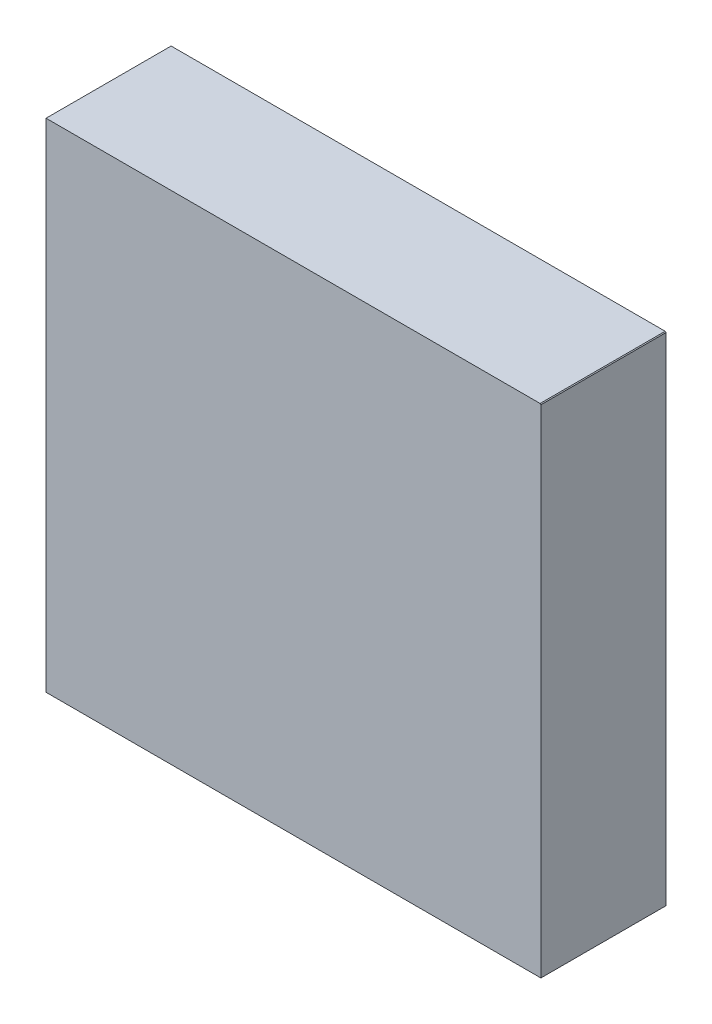
ISO-10303-21;
HEADER;
FILE_DESCRIPTION(('STEP AP214'),'2;1');
FILE_NAME('part.step','',(''),(''),'','','');
FILE_SCHEMA(('AUTOMOTIVE_DESIGN { 1 0 10303 214 1 1 1 1 }'));
ENDSEC;
DATA;
#1=APPLICATION_CONTEXT('core data for automotive mechanical design processes');
#2=APPLICATION_PROTOCOL_DEFINITION('international standard','automotive_design',2000,#1);
#3=PRODUCT_CONTEXT('',#1,'mechanical');
#4=PRODUCT('Part','Part','',(#3));
#5=PRODUCT_RELATED_PRODUCT_CATEGORY('part','',(#4));
#6=PRODUCT_DEFINITION_FORMATION('','',#4);
#7=PRODUCT_DEFINITION_CONTEXT('part definition',#1,'design');
#8=PRODUCT_DEFINITION('design','',#6,#7);
#9=PRODUCT_DEFINITION_SHAPE('','',#8);
#10=(LENGTH_UNIT() NAMED_UNIT(*) SI_UNIT(.MILLI.,.METRE.));
#11=(NAMED_UNIT(*) PLANE_ANGLE_UNIT() SI_UNIT($,.RADIAN.));
#12=(NAMED_UNIT(*) SI_UNIT($,.STERADIAN.) SOLID_ANGLE_UNIT());
#13=UNCERTAINTY_MEASURE_WITH_UNIT(LENGTH_MEASURE(1.E-05),#10,'distance_accuracy_value','');
#14=(GEOMETRIC_REPRESENTATION_CONTEXT(3) GLOBAL_UNCERTAINTY_ASSIGNED_CONTEXT((#13)) GLOBAL_UNIT_ASSIGNED_CONTEXT((#10,
#11,#12)) REPRESENTATION_CONTEXT('',''));
#15=CARTESIAN_POINT('',(0.,0.,0.));
#16=DIRECTION('',(0.,0.,1.));
#17=DIRECTION('',(1.,0.,0.));
#18=AXIS2_PLACEMENT_3D('',#15,#16,#17);
#19=CARTESIAN_POINT('',(-1.58250128,1.58999936,0.80000094));
#20=DIRECTION('',(0.,0.,-1.));
#21=DIRECTION('',(0.,-1.,0.));
#22=AXIS2_PLACEMENT_3D('',#19,#20,#21);
#23=PLANE('',#22);
#24=DIRECTION('',(0.,-1.,0.));
#25=VECTOR('',#24,1.);
#26=CARTESIAN_POINT('',(-1.58250128,1.58999936,0.80000094));
#27=LINE('',#26,#25);
#28=CARTESIAN_POINT('',(-1.58250128,1.58999936,0.80000094));
#29=VERTEX_POINT('',#28);
#30=CARTESIAN_POINT('',(-1.5824962,-1.58999682,0.80000094));
#31=VERTEX_POINT('',#30);
#32=EDGE_CURVE('E93',#29,#31,#27,.T.);
#33=ORIENTED_EDGE('',*,*,#32,.T.);
#34=DIRECTION('',(1.,0.,0.));
#35=VECTOR('',#34,1.);
#36=CARTESIAN_POINT('',(-1.5824962,-1.58999682,0.80000094));
#37=LINE('',#36,#35);
#38=CARTESIAN_POINT('',(1.58250128,-1.58999682,0.80000094));
#39=VERTEX_POINT('',#38);
#40=EDGE_CURVE('E91',#31,#39,#37,.T.);
#41=ORIENTED_EDGE('',*,*,#40,.T.);
#42=DIRECTION('',(0.,1.,0.));
#43=VECTOR('',#42,1.);
#44=CARTESIAN_POINT('',(1.58250128,-1.58999682,0.80000094));
#45=LINE('',#44,#43);
#46=CARTESIAN_POINT('',(1.58250128,1.5849981,0.80000094));
#47=VERTEX_POINT('',#46);
#48=EDGE_CURVE('E77',#39,#47,#45,.T.);
#49=ORIENTED_EDGE('',*,*,#48,.T.);
#50=DIRECTION('',(-0.707106781186548,0.707106781186548,0.));
#51=VECTOR('',#50,1.);
#52=CARTESIAN_POINT('',(1.58250128,1.5849981,0.80000094));
#53=LINE('',#52,#51);
#54=CARTESIAN_POINT('',(1.57750002,1.58999936,0.80000094));
#55=VERTEX_POINT('',#54);
#56=EDGE_CURVE('E119',#47,#55,#53,.T.);
#57=ORIENTED_EDGE('',*,*,#56,.T.);
#58=DIRECTION('',(-1.,0.,0.));
#59=VECTOR('',#58,1.);
#60=CARTESIAN_POINT('',(1.57750002,1.58999936,0.80000094));
#61=LINE('',#60,#59);
#62=EDGE_CURVE('E26',#55,#29,#61,.T.);
#63=ORIENTED_EDGE('',*,*,#62,.T.);
#64=EDGE_LOOP('',(#33,#41,#49,#57,#63));
#65=FACE_BOUND('',#64,.T.);
#66=ADVANCED_FACE('F17',(#65),#23,.F.);
#67=CARTESIAN_POINT('',(-1.58250128,1.58999936,0.));
#68=DIRECTION('',(0.,0.,-1.));
#69=DIRECTION('',(0.,-1.,0.));
#70=AXIS2_PLACEMENT_3D('',#67,#68,#69);
#71=PLANE('',#70);
#72=DIRECTION('',(-1.,0.,0.));
#73=VECTOR('',#72,1.);
#74=CARTESIAN_POINT('',(1.57750002,1.58999936,0.));
#75=LINE('',#74,#73);
#76=CARTESIAN_POINT('',(1.57750002,1.58999936,0.));
#77=VERTEX_POINT('',#76);
#78=CARTESIAN_POINT('',(-1.58250128,1.58999936,0.));
#79=VERTEX_POINT('',#78);
#80=EDGE_CURVE('E122',#77,#79,#75,.T.);
#81=ORIENTED_EDGE('',*,*,#80,.F.);
#82=DIRECTION('',(-0.707106781186548,0.707106781186548,0.));
#83=VECTOR('',#82,1.);
#84=CARTESIAN_POINT('',(1.58250128,1.5849981,0.));
#85=LINE('',#84,#83);
#86=CARTESIAN_POINT('',(1.58250128,1.5849981,0.));
#87=VERTEX_POINT('',#86);
#88=EDGE_CURVE('E87',#87,#77,#85,.T.);
#89=ORIENTED_EDGE('',*,*,#88,.F.);
#90=DIRECTION('',(0.,1.,0.));
#91=VECTOR('',#90,1.);
#92=CARTESIAN_POINT('',(1.58250128,-1.58999682,0.));
#93=LINE('',#92,#91);
#94=CARTESIAN_POINT('',(1.58250128,-1.58999682,0.));
#95=VERTEX_POINT('',#94);
#96=EDGE_CURVE('E69',#95,#87,#93,.T.);
#97=ORIENTED_EDGE('',*,*,#96,.F.);
#98=DIRECTION('',(1.,0.,0.));
#99=VECTOR('',#98,1.);
#100=CARTESIAN_POINT('',(-1.5824962,-1.58999682,0.));
#101=LINE('',#100,#99);
#102=CARTESIAN_POINT('',(-1.5824962,-1.58999682,0.));
#103=VERTEX_POINT('',#102);
#104=EDGE_CURVE('E98',#103,#95,#101,.T.);
#105=ORIENTED_EDGE('',*,*,#104,.F.);
#106=DIRECTION('',(0.,-1.,0.));
#107=VECTOR('',#106,1.);
#108=CARTESIAN_POINT('',(-1.58250128,1.58999936,0.));
#109=LINE('',#108,#107);
#110=EDGE_CURVE('E128',#79,#103,#109,.T.);
#111=ORIENTED_EDGE('',*,*,#110,.F.);
#112=EDGE_LOOP('',(#81,#89,#97,#105,#111));
#113=FACE_BOUND('',#112,.T.);
#114=ADVANCED_FACE('F145',(#113),#71,.T.);
#115=CARTESIAN_POINT('',(1.57750002,1.58999936,0.));
#116=DIRECTION('',(0.,-1.,0.));
#117=DIRECTION('',(0.,0.,-1.));
#118=AXIS2_PLACEMENT_3D('',#115,#116,#117);
#119=PLANE('',#118);
#120=ORIENTED_EDGE('',*,*,#80,.T.);
#121=DIRECTION('',(0.,0.,1.));
#122=VECTOR('',#121,1.);
#123=CARTESIAN_POINT('',(-1.58250128,1.58999936,0.));
#124=LINE('',#123,#122);
#125=EDGE_CURVE('E105',#79,#29,#124,.T.);
#126=ORIENTED_EDGE('',*,*,#125,.T.);
#127=ORIENTED_EDGE('',*,*,#62,.F.);
#128=DIRECTION('',(0.,0.,1.));
#129=VECTOR('',#128,1.);
#130=CARTESIAN_POINT('',(1.57750002,1.58999936,0.));
#131=LINE('',#130,#129);
#132=EDGE_CURVE('E113',#77,#55,#131,.T.);
#133=ORIENTED_EDGE('',*,*,#132,.F.);
#134=EDGE_LOOP('',(#120,#126,#127,#133));
#135=FACE_BOUND('',#134,.T.);
#136=ADVANCED_FACE('F147',(#135),#119,.F.);
#137=CARTESIAN_POINT('',(1.58250128,1.5849981,0.));
#138=DIRECTION('',(-0.707106781186548,-0.707106781186548,0.));
#139=DIRECTION('',(-0.707106781186548,0.707106781186548,0.));
#140=AXIS2_PLACEMENT_3D('',#137,#138,#139);
#141=PLANE('',#140);
#142=ORIENTED_EDGE('',*,*,#88,.T.);
#143=ORIENTED_EDGE('',*,*,#132,.T.);
#144=ORIENTED_EDGE('',*,*,#56,.F.);
#145=DIRECTION('',(0.,0.,1.));
#146=VECTOR('',#145,1.);
#147=CARTESIAN_POINT('',(1.58250128,1.5849981,0.));
#148=LINE('',#147,#146);
#149=EDGE_CURVE('E84',#87,#47,#148,.T.);
#150=ORIENTED_EDGE('',*,*,#149,.F.);
#151=EDGE_LOOP('',(#142,#143,#144,#150));
#152=FACE_BOUND('',#151,.T.);
#153=ADVANCED_FACE('F153',(#152),#141,.F.);
#154=CARTESIAN_POINT('',(1.58250128,-1.58999682,0.));
#155=DIRECTION('',(-1.,0.,0.));
#156=DIRECTION('',(0.,0.,1.));
#157=AXIS2_PLACEMENT_3D('',#154,#155,#156);
#158=PLANE('',#157);
#159=ORIENTED_EDGE('',*,*,#96,.T.);
#160=ORIENTED_EDGE('',*,*,#149,.T.);
#161=ORIENTED_EDGE('',*,*,#48,.F.);
#162=DIRECTION('',(0.,0.,1.));
#163=VECTOR('',#162,1.);
#164=CARTESIAN_POINT('',(1.58250128,-1.58999682,0.));
#165=LINE('',#164,#163);
#166=EDGE_CURVE('E81',#95,#39,#165,.T.);
#167=ORIENTED_EDGE('',*,*,#166,.F.);
#168=EDGE_LOOP('',(#159,#160,#161,#167));
#169=FACE_BOUND('',#168,.T.);
#170=ADVANCED_FACE('F79',(#169),#158,.F.);
#171=CARTESIAN_POINT('',(-1.5824962,-1.58999682,0.));
#172=DIRECTION('',(0.,1.,0.));
#173=DIRECTION('',(1.,0.,0.));
#174=AXIS2_PLACEMENT_3D('',#171,#172,#173);
#175=PLANE('',#174);
#176=DIRECTION('',(0.,0.,-1.));
#177=VECTOR('',#176,1.);
#178=CARTESIAN_POINT('',(-1.58250128,-1.58999682,0.));
#179=LINE('',#178,#177);
#180=EDGE_CURVE('E11',#103,#31,#179,.F.);
#181=ORIENTED_EDGE('',*,*,#180,.F.);
#182=ORIENTED_EDGE('',*,*,#104,.T.);
#183=ORIENTED_EDGE('',*,*,#166,.T.);
#184=ORIENTED_EDGE('',*,*,#40,.F.);
#185=EDGE_LOOP('',(#181,#182,#183,#184));
#186=FACE_BOUND('',#185,.T.);
#187=ADVANCED_FACE('F97',(#186),#175,.F.);
#188=CARTESIAN_POINT('',(-1.58250128,1.58999936,0.));
#189=DIRECTION('',(1.,0.,0.));
#190=DIRECTION('',(0.,1.,0.));
#191=AXIS2_PLACEMENT_3D('',#188,#189,#190);
#192=PLANE('',#191);
#193=ORIENTED_EDGE('',*,*,#110,.T.);
#194=ORIENTED_EDGE('',*,*,#180,.T.);
#195=ORIENTED_EDGE('',*,*,#32,.F.);
#196=ORIENTED_EDGE('',*,*,#125,.F.);
#197=EDGE_LOOP('',(#193,#194,#195,#196));
#198=FACE_BOUND('',#197,.T.);
#199=ADVANCED_FACE('F144',(#198),#192,.F.);
#200=CLOSED_SHELL('',(#66,#114,#136,#153,#170,#187,#199));
#201=MANIFOLD_SOLID_BREP('B1',#200);
#202=ADVANCED_BREP_SHAPE_REPRESENTATION('',(#18,#201),#14);
#203=SHAPE_DEFINITION_REPRESENTATION(#9,#202);
ENDSEC;
END-ISO-10303-21;
